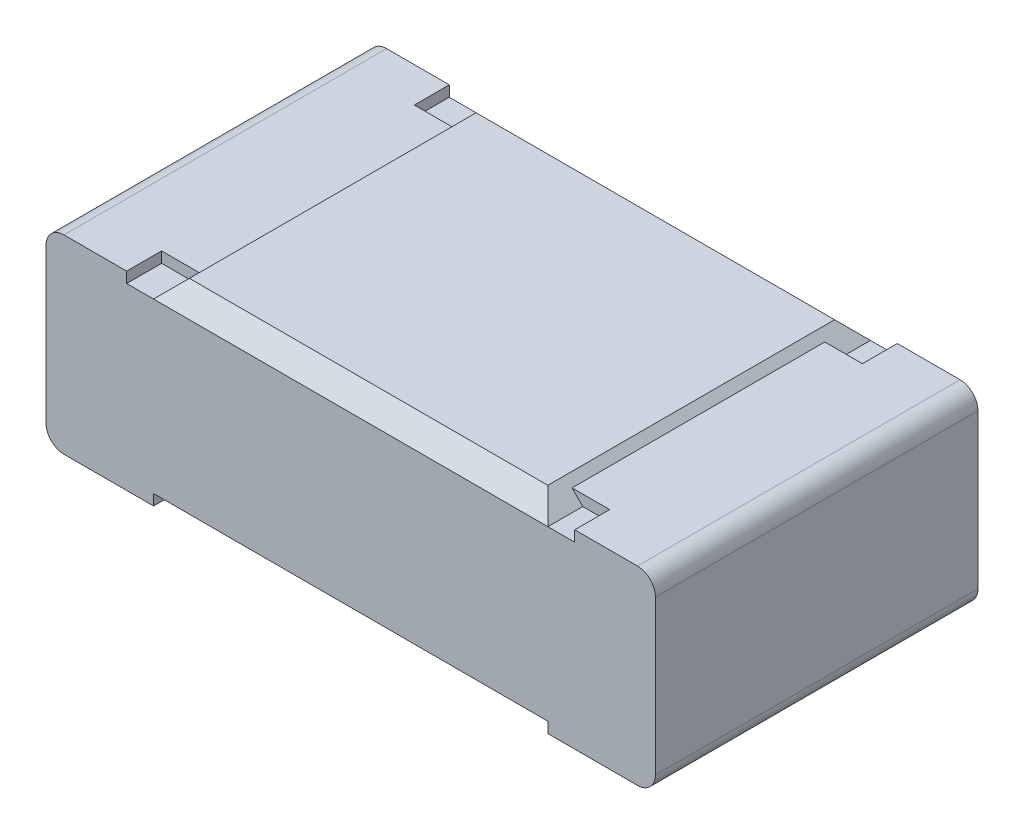
ISO-10303-21;
HEADER;
FILE_DESCRIPTION(('STEP AP214'),'2;1');
FILE_NAME('part.step','',(''),(''),'','','');
FILE_SCHEMA(('AUTOMOTIVE_DESIGN { 1 0 10303 214 1 1 1 1 }'));
ENDSEC;
DATA;
#1=APPLICATION_CONTEXT('core data for automotive mechanical design processes');
#2=APPLICATION_PROTOCOL_DEFINITION('international standard','automotive_design',2000,#1);
#3=PRODUCT_CONTEXT('',#1,'mechanical');
#4=PRODUCT('Part','Part','',(#3));
#5=PRODUCT_RELATED_PRODUCT_CATEGORY('part','',(#4));
#6=PRODUCT_DEFINITION_FORMATION('','',#4);
#7=PRODUCT_DEFINITION_CONTEXT('part definition',#1,'design');
#8=PRODUCT_DEFINITION('design','',#6,#7);
#9=PRODUCT_DEFINITION_SHAPE('','',#8);
#10=(LENGTH_UNIT() NAMED_UNIT(*) SI_UNIT(.MILLI.,.METRE.));
#11=(NAMED_UNIT(*) PLANE_ANGLE_UNIT() SI_UNIT($,.RADIAN.));
#12=(NAMED_UNIT(*) SI_UNIT($,.STERADIAN.) SOLID_ANGLE_UNIT());
#13=UNCERTAINTY_MEASURE_WITH_UNIT(LENGTH_MEASURE(1.E-05),#10,'distance_accuracy_value','');
#14=(GEOMETRIC_REPRESENTATION_CONTEXT(3) GLOBAL_UNCERTAINTY_ASSIGNED_CONTEXT((#13)) GLOBAL_UNIT_ASSIGNED_CONTEXT((#10,
#11,#12)) REPRESENTATION_CONTEXT('',''));
#15=CARTESIAN_POINT('',(0.,0.,0.));
#16=DIRECTION('',(0.,0.,1.));
#17=DIRECTION('',(1.,0.,0.));
#18=AXIS2_PLACEMENT_3D('',#15,#16,#17);
#19=CARTESIAN_POINT('',(-2.052710128787,-22.36241513081,1.021662858095));
#20=DIRECTION('',(1.,0.,0.));
#21=DIRECTION('',(0.,0.,-1.));
#22=AXIS2_PLACEMENT_3D('',#19,#20,#21);
#23=PLANE('',#22);
#24=DIRECTION('',(0.,1.,0.));
#25=VECTOR('',#24,1.);
#26=CARTESIAN_POINT('',(-2.052710128787,-22.36241513081,0.924162858095));
#27=LINE('',#26,#25);
#28=CARTESIAN_POINT('',(-2.052710128787,-22.3624151309644,0.924162858095));
#29=VERTEX_POINT('',#28);
#30=CARTESIAN_POINT('',(-2.052710128787,-22.33241513081,0.924162858095001));
#31=VERTEX_POINT('',#30);
#32=EDGE_CURVE('E396',#29,#31,#27,.T.);
#33=ORIENTED_EDGE('',*,*,#32,.F.);
#34=DIRECTION('',(0.,0.,1.));
#35=VECTOR('',#34,1.);
#36=CARTESIAN_POINT('',(-2.052710128787,-22.3624151311376,1.824162858095));
#37=LINE('',#36,#35);
#38=CARTESIAN_POINT('',(-2.052710128787,-22.3624151311376,1.021662858095));
#39=VERTEX_POINT('',#38);
#40=EDGE_CURVE('E246',#39,#29,#37,.F.);
#41=ORIENTED_EDGE('',*,*,#40,.F.);
#42=DIRECTION('',(0.,1.,0.));
#43=VECTOR('',#42,1.);
#44=CARTESIAN_POINT('',(-2.052710128787,-22.36241513081,1.021662858095));
#45=LINE('',#44,#43);
#46=CARTESIAN_POINT('',(-2.052710128787,-22.33241513081,1.021662858095));
#47=VERTEX_POINT('',#46);
#48=EDGE_CURVE('E380',#39,#47,#45,.T.);
#49=ORIENTED_EDGE('',*,*,#48,.T.);
#50=DIRECTION('',(0.,0.,1.));
#51=VECTOR('',#50,1.);
#52=CARTESIAN_POINT('',(-2.052710128787,-22.33241513081,1.824162858095));
#53=LINE('',#52,#51);
#54=EDGE_CURVE('E341',#31,#47,#53,.T.);
#55=ORIENTED_EDGE('',*,*,#54,.F.);
#56=EDGE_LOOP('',(#33,#41,#49,#55));
#57=FACE_BOUND('',#56,.T.);
#58=ADVANCED_FACE('F17',(#57),#23,.F.);
#59=CARTESIAN_POINT('',(-3.302710128787,-22.36241513081,1.021662858095));
#60=DIRECTION('',(0.,0.,1.));
#61=DIRECTION('',(1.,0.,0.));
#62=AXIS2_PLACEMENT_3D('',#59,#60,#61);
#63=PLANE('',#62);
#64=DIRECTION('',(-1.,0.,0.));
#65=VECTOR('',#64,1.);
#66=CARTESIAN_POINT('',(-2.227710128787,-22.33241513081,1.021662858095));
#67=LINE('',#66,#65);
#68=CARTESIAN_POINT('',(-2.15771012878251,-22.3324151308105,1.021662858095));
#69=VERTEX_POINT('',#68);
#70=EDGE_CURVE('E337',#47,#69,#67,.T.);
#71=ORIENTED_EDGE('',*,*,#70,.F.);
#72=ORIENTED_EDGE('',*,*,#48,.F.);
#73=DIRECTION('',(-1.,5.246521980196E-10,0.));
#74=VECTOR('',#73,1.);
#75=CARTESIAN_POINT('',(-3.477710128525,-22.36241513039,1.021662858095));
#76=LINE('',#75,#74);
#77=CARTESIAN_POINT('',(-2.12771012852529,-22.3624151310986,1.021662858095));
#78=VERTEX_POINT('',#77);
#79=EDGE_CURVE('E225',#78,#39,#76,.F.);
#80=ORIENTED_EDGE('',*,*,#79,.F.);
#81=DIRECTION('',(-0.707106780815548,0.707106781557548,0.));
#82=VECTOR('',#81,1.);
#83=CARTESIAN_POINT('',(-2.127710128525,-22.3624151311,1.021662858095));
#84=LINE('',#83,#82);
#85=EDGE_CURVE('E300',#69,#78,#84,.F.);
#86=ORIENTED_EDGE('',*,*,#85,.F.);
#87=EDGE_LOOP('',(#71,#72,#80,#86));
#88=FACE_BOUND('',#87,.T.);
#89=ADVANCED_FACE('F576',(#88),#63,.F.);
#90=CARTESIAN_POINT('',(-3.302710128787,-22.36241513081,0.924162858095));
#91=DIRECTION('',(-1.,0.,0.));
#92=DIRECTION('',(0.,0.,1.));
#93=AXIS2_PLACEMENT_3D('',#90,#91,#92);
#94=PLANE('',#93);
#95=DIRECTION('',(0.,1.,0.));
#96=VECTOR('',#95,1.);
#97=CARTESIAN_POINT('',(-3.302710128787,-22.36241513081,1.021662858095));
#98=LINE('',#97,#96);
#99=CARTESIAN_POINT('',(-3.302710128787,-22.33241513081,1.021662858095));
#100=VERTEX_POINT('',#99);
#101=CARTESIAN_POINT('',(-3.302710128787,-22.3624151304818,1.021662858095));
#102=VERTEX_POINT('',#101);
#103=EDGE_CURVE('E363',#100,#102,#98,.F.);
#104=ORIENTED_EDGE('',*,*,#103,.T.);
#105=DIRECTION('',(0.,0.,1.));
#106=VECTOR('',#105,1.);
#107=CARTESIAN_POINT('',(-3.302710128787,-22.3624151304818,1.824162858095));
#108=LINE('',#107,#106);
#109=CARTESIAN_POINT('',(-3.302710128787,-22.362415130728,0.924162858094999));
#110=VERTEX_POINT('',#109);
#111=EDGE_CURVE('E376',#110,#102,#108,.T.);
#112=ORIENTED_EDGE('',*,*,#111,.F.);
#113=DIRECTION('',(0.,1.,0.));
#114=VECTOR('',#113,1.);
#115=CARTESIAN_POINT('',(-3.302710128787,-22.86241513081,0.924162858094999));
#116=LINE('',#115,#114);
#117=CARTESIAN_POINT('',(-3.302710128787,-22.33241513081,0.924162858094999));
#118=VERTEX_POINT('',#117);
#119=EDGE_CURVE('E236',#118,#110,#116,.F.);
#120=ORIENTED_EDGE('',*,*,#119,.F.);
#121=DIRECTION('',(0.,0.,1.));
#122=VECTOR('',#121,1.);
#123=CARTESIAN_POINT('',(-3.302710128787,-22.33241513081,1.824162858095));
#124=LINE('',#123,#122);
#125=EDGE_CURVE('E322',#100,#118,#124,.F.);
#126=ORIENTED_EDGE('',*,*,#125,.F.);
#127=EDGE_LOOP('',(#104,#112,#120,#126));
#128=FACE_BOUND('',#127,.T.);
#129=ADVANCED_FACE('F927',(#128),#94,.F.);
#130=CARTESIAN_POINT('',(-3.302710128787,-22.36241513081,1.021662858095));
#131=DIRECTION('',(0.,0.,1.));
#132=DIRECTION('',(1.,0.,0.));
#133=AXIS2_PLACEMENT_3D('',#130,#131,#132);
#134=PLANE('',#133);
#135=DIRECTION('',(-1.,5.246521980196E-10,0.));
#136=VECTOR('',#135,1.);
#137=CARTESIAN_POINT('',(-3.477710128525,-22.36241513039,1.021662858095));
#138=LINE('',#137,#136);
#139=CARTESIAN_POINT('',(-3.22771012852519,-22.362415130521,1.021662858095));
#140=VERTEX_POINT('',#139);
#141=EDGE_CURVE('E276',#102,#140,#138,.F.);
#142=ORIENTED_EDGE('',*,*,#141,.F.);
#143=ORIENTED_EDGE('',*,*,#103,.F.);
#144=DIRECTION('',(-1.,0.,0.));
#145=VECTOR('',#144,1.);
#146=CARTESIAN_POINT('',(-3.477710128787,-22.33241513081,1.021662858095));
#147=LINE('',#146,#145);
#148=CARTESIAN_POINT('',(-3.19771012878276,-22.3324151308095,1.021662858095));
#149=VERTEX_POINT('',#148);
#150=EDGE_CURVE('E326',#149,#100,#147,.T.);
#151=ORIENTED_EDGE('',*,*,#150,.F.);
#152=DIRECTION('',(-0.707106781557548,-0.707106780815548,0.));
#153=VECTOR('',#152,1.);
#154=CARTESIAN_POINT('',(-3.227710128525,-22.36241513052,1.021662858095));
#155=LINE('',#154,#153);
#156=EDGE_CURVE('E299',#140,#149,#155,.F.);
#157=ORIENTED_EDGE('',*,*,#156,.F.);
#158=EDGE_LOOP('',(#142,#143,#151,#157));
#159=FACE_BOUND('',#158,.T.);
#160=ADVANCED_FACE('F633',(#159),#134,.F.);
#161=CARTESIAN_POINT('',(-2.052710128787,-22.36241513081,1.824162858095));
#162=DIRECTION('',(1.,0.,0.));
#163=DIRECTION('',(0.,1.,0.));
#164=AXIS2_PLACEMENT_3D('',#161,#162,#163);
#165=PLANE('',#164);
#166=DIRECTION('',(0.,1.,0.));
#167=VECTOR('',#166,1.);
#168=CARTESIAN_POINT('',(-2.052710128787,-22.36241513081,1.726662858095));
#169=LINE('',#168,#167);
#170=CARTESIAN_POINT('',(-2.052710128787,-22.33241513081,1.726662858095));
#171=VERTEX_POINT('',#170);
#172=CARTESIAN_POINT('',(-2.052710128787,-22.3624151311376,1.726662858095));
#173=VERTEX_POINT('',#172);
#174=EDGE_CURVE('E357',#171,#173,#169,.F.);
#175=ORIENTED_EDGE('',*,*,#174,.T.);
#176=DIRECTION('',(0.,0.,1.));
#177=VECTOR('',#176,1.);
#178=CARTESIAN_POINT('',(-2.052710128787,-22.3624151311376,1.824162858095));
#179=LINE('',#178,#177);
#180=CARTESIAN_POINT('',(-2.052710128787,-22.3624151309644,1.824162858095));
#181=VERTEX_POINT('',#180);
#182=EDGE_CURVE('E334',#181,#173,#179,.F.);
#183=ORIENTED_EDGE('',*,*,#182,.F.);
#184=DIRECTION('',(0.,1.,0.));
#185=VECTOR('',#184,1.);
#186=CARTESIAN_POINT('',(-2.052710128787,-22.36241513081,1.824162858095));
#187=LINE('',#186,#185);
#188=CARTESIAN_POINT('',(-2.052710128787,-22.33241513081,1.824162858095));
#189=VERTEX_POINT('',#188);
#190=EDGE_CURVE('E359',#189,#181,#187,.F.);
#191=ORIENTED_EDGE('',*,*,#190,.F.);
#192=DIRECTION('',(0.,0.,1.));
#193=VECTOR('',#192,1.);
#194=CARTESIAN_POINT('',(-2.052710128787,-22.33241513081,1.824162858095));
#195=LINE('',#194,#193);
#196=EDGE_CURVE('E338',#171,#189,#195,.T.);
#197=ORIENTED_EDGE('',*,*,#196,.F.);
#198=EDGE_LOOP('',(#175,#183,#191,#197));
#199=FACE_BOUND('',#198,.T.);
#200=ADVANCED_FACE('F598',(#199),#165,.F.);
#201=CARTESIAN_POINT('',(-2.052710128787,-22.36241513081,1.726662858095));
#202=DIRECTION('',(0.,0.,-1.));
#203=DIRECTION('',(-1.,0.,0.));
#204=AXIS2_PLACEMENT_3D('',#201,#202,#203);
#205=PLANE('',#204);
#206=DIRECTION('',(-1.,5.246521980196E-10,0.));
#207=VECTOR('',#206,1.);
#208=CARTESIAN_POINT('',(-3.477710128525,-22.36241513039,1.726662858095));
#209=LINE('',#208,#207);
#210=CARTESIAN_POINT('',(-2.12771012852529,-22.3624151310986,1.726662858095));
#211=VERTEX_POINT('',#210);
#212=EDGE_CURVE('E351',#173,#211,#209,.T.);
#213=ORIENTED_EDGE('',*,*,#212,.F.);
#214=ORIENTED_EDGE('',*,*,#174,.F.);
#215=DIRECTION('',(-1.,0.,0.));
#216=VECTOR('',#215,1.);
#217=CARTESIAN_POINT('',(-2.227710128787,-22.33241513081,1.726662858095));
#218=LINE('',#217,#216);
#219=CARTESIAN_POINT('',(-2.15771012878276,-22.3324151308105,1.726662858095));
#220=VERTEX_POINT('',#219);
#221=EDGE_CURVE('E342',#220,#171,#218,.F.);
#222=ORIENTED_EDGE('',*,*,#221,.F.);
#223=DIRECTION('',(-0.707106780815548,0.707106781557548,0.));
#224=VECTOR('',#223,1.);
#225=CARTESIAN_POINT('',(-2.127710128525,-22.3624151311,1.726662858095));
#226=LINE('',#225,#224);
#227=EDGE_CURVE('E345',#211,#220,#226,.T.);
#228=ORIENTED_EDGE('',*,*,#227,.F.);
#229=EDGE_LOOP('',(#213,#214,#222,#228));
#230=FACE_BOUND('',#229,.T.);
#231=ADVANCED_FACE('F566',(#230),#205,.F.);
#232=CARTESIAN_POINT('',(-2.227710128787,-22.33241513081,1.824162858095));
#233=DIRECTION('',(0.,1.,0.));
#234=DIRECTION('',(-1.,0.,0.));
#235=AXIS2_PLACEMENT_3D('',#232,#233,#234);
#236=PLANE('',#235);
#237=ORIENTED_EDGE('',*,*,#54,.T.);
#238=ORIENTED_EDGE('',*,*,#70,.T.);
#239=DIRECTION('',(0.,0.,1.));
#240=VECTOR('',#239,1.);
#241=CARTESIAN_POINT('',(-2.15771012878276,-22.3324151308108,1.824162858095));
#242=LINE('',#241,#240);
#243=EDGE_CURVE('E348',#220,#69,#242,.F.);
#244=ORIENTED_EDGE('',*,*,#243,.F.);
#245=ORIENTED_EDGE('',*,*,#221,.T.);
#246=ORIENTED_EDGE('',*,*,#196,.T.);
#247=DIRECTION('',(-1.,0.,0.));
#248=VECTOR('',#247,1.);
#249=CARTESIAN_POINT('',(-2.677710128787,-22.33241513081,1.824162858095));
#250=LINE('',#249,#248);
#251=CARTESIAN_POINT('',(-1.877710128787,-22.33241513081,1.824162858095));
#252=VERTEX_POINT('',#251);
#253=EDGE_CURVE('E448',#189,#252,#250,.F.);
#254=ORIENTED_EDGE('',*,*,#253,.T.);
#255=DIRECTION('',(0.,0.,-1.));
#256=VECTOR('',#255,1.);
#257=CARTESIAN_POINT('',(-1.877710128787,-22.33241513081,1.824162858095));
#258=LINE('',#257,#256);
#259=CARTESIAN_POINT('',(-1.877710128787,-22.33241513081,0.924162858095001));
#260=VERTEX_POINT('',#259);
#261=EDGE_CURVE('E198',#260,#252,#258,.F.);
#262=ORIENTED_EDGE('',*,*,#261,.F.);
#263=DIRECTION('',(-1.,0.,0.));
#264=VECTOR('',#263,1.);
#265=CARTESIAN_POINT('',(-2.677710128787,-22.33241513081,0.924162858095));
#266=LINE('',#265,#264);
#267=EDGE_CURVE('E224',#31,#260,#266,.F.);
#268=ORIENTED_EDGE('',*,*,#267,.F.);
#269=EDGE_LOOP('',(#237,#238,#244,#245,#246,#254,#262,#268));
#270=FACE_BOUND('',#269,.T.);
#271=ADVANCED_FACE('F571',(#270),#236,.T.);
#272=CARTESIAN_POINT('',(-1.877710128787,-22.38241513081,1.824162858095));
#273=DIRECTION('',(0.,0.,-1.));
#274=DIRECTION('',(-1.,0.,0.));
#275=AXIS2_PLACEMENT_3D('',#272,#273,#274);
#276=CYLINDRICAL_SURFACE('',#275,0.05);
#277=CARTESIAN_POINT('',(-1.877710128787,-22.38241513081,0.924162858095));
#278=DIRECTION('',(0.,0.,-1.));
#279=DIRECTION('',(-1.,0.,0.));
#280=AXIS2_PLACEMENT_3D('',#277,#278,#279);
#281=CIRCLE('',#280,0.05);
#282=CARTESIAN_POINT('',(-1.827710128787,-22.38241513081,0.924162858095001));
#283=VERTEX_POINT('',#282);
#284=EDGE_CURVE('E20',#260,#283,#281,.T.);
#285=ORIENTED_EDGE('',*,*,#284,.F.);
#286=ORIENTED_EDGE('',*,*,#261,.T.);
#287=CARTESIAN_POINT('',(-1.877710128787,-22.38241513081,1.824162858095));
#288=DIRECTION('',(0.,0.,-1.));
#289=DIRECTION('',(-1.,0.,0.));
#290=AXIS2_PLACEMENT_3D('',#287,#288,#289);
#291=CIRCLE('',#290,0.05);
#292=CARTESIAN_POINT('',(-1.827710128787,-22.38241513081,1.824162858095));
#293=VERTEX_POINT('',#292);
#294=EDGE_CURVE('E209',#252,#293,#291,.T.);
#295=ORIENTED_EDGE('',*,*,#294,.T.);
#296=DIRECTION('',(0.,0.,-1.));
#297=VECTOR('',#296,1.);
#298=CARTESIAN_POINT('',(-1.827710128787,-22.38241513081,1.824162858095));
#299=LINE('',#298,#297);
#300=EDGE_CURVE('E203',#283,#293,#299,.F.);
#301=ORIENTED_EDGE('',*,*,#300,.F.);
#302=EDGE_LOOP('',(#285,#286,#295,#301));
#303=FACE_BOUND('',#302,.T.);
#304=ADVANCED_FACE('F205',(#303),#276,.T.);
#305=CARTESIAN_POINT('',(-1.827710128787,-22.38241513081,1.824162858095));
#306=DIRECTION('',(1.,0.,0.));
#307=DIRECTION('',(0.,0.,-1.));
#308=AXIS2_PLACEMENT_3D('',#305,#306,#307);
#309=PLANE('',#308);
#310=DIRECTION('',(0.,1.,0.));
#311=VECTOR('',#310,1.);
#312=CARTESIAN_POINT('',(-1.827710128787,-22.86241513081,0.924162858095001));
#313=LINE('',#312,#311);
#314=CARTESIAN_POINT('',(-1.827710128787,-22.81241513081,0.924162858095001));
#315=VERTEX_POINT('',#314);
#316=EDGE_CURVE('E215',#283,#315,#313,.F.);
#317=ORIENTED_EDGE('',*,*,#316,.F.);
#318=ORIENTED_EDGE('',*,*,#300,.T.);
#319=DIRECTION('',(0.,1.,0.));
#320=VECTOR('',#319,1.);
#321=CARTESIAN_POINT('',(-1.827710128787,-22.86241513081,1.824162858095));
#322=LINE('',#321,#320);
#323=CARTESIAN_POINT('',(-1.827710128787,-22.81241513081,1.824162858095));
#324=VERTEX_POINT('',#323);
#325=EDGE_CURVE('E446',#293,#324,#322,.F.);
#326=ORIENTED_EDGE('',*,*,#325,.T.);
#327=DIRECTION('',(0.,0.,-1.));
#328=VECTOR('',#327,1.);
#329=CARTESIAN_POINT('',(-1.827710128787,-22.81241513081,1.824162858095));
#330=LINE('',#329,#328);
#331=EDGE_CURVE('E212',#315,#324,#330,.F.);
#332=ORIENTED_EDGE('',*,*,#331,.F.);
#333=EDGE_LOOP('',(#317,#318,#326,#332));
#334=FACE_BOUND('',#333,.T.);
#335=ADVANCED_FACE('F216',(#334),#309,.T.);
#336=CARTESIAN_POINT('',(-1.877710128787,-22.81241513081,1.824162858095));
#337=DIRECTION('',(0.,0.,-1.));
#338=DIRECTION('',(-1.,0.,0.));
#339=AXIS2_PLACEMENT_3D('',#336,#337,#338);
#340=CYLINDRICAL_SURFACE('',#339,0.05);
#341=CARTESIAN_POINT('',(-1.877710128787,-22.81241513081,0.924162858095));
#342=DIRECTION('',(0.,0.,-1.));
#343=DIRECTION('',(-1.,0.,0.));
#344=AXIS2_PLACEMENT_3D('',#341,#342,#343);
#345=CIRCLE('',#344,0.05);
#346=CARTESIAN_POINT('',(-1.877710128787,-22.86241513081,0.924162858095));
#347=VERTEX_POINT('',#346);
#348=EDGE_CURVE('E220',#315,#347,#345,.T.);
#349=ORIENTED_EDGE('',*,*,#348,.F.);
#350=ORIENTED_EDGE('',*,*,#331,.T.);
#351=CARTESIAN_POINT('',(-1.877710128787,-22.81241513081,1.824162858095));
#352=DIRECTION('',(0.,0.,-1.));
#353=DIRECTION('',(-1.,0.,0.));
#354=AXIS2_PLACEMENT_3D('',#351,#352,#353);
#355=CIRCLE('',#354,0.05);
#356=CARTESIAN_POINT('',(-1.877710128787,-22.86241513081,1.824162858095));
#357=VERTEX_POINT('',#356);
#358=EDGE_CURVE('E443',#324,#357,#355,.T.);
#359=ORIENTED_EDGE('',*,*,#358,.T.);
#360=DIRECTION('',(0.,0.,1.));
#361=VECTOR('',#360,1.);
#362=CARTESIAN_POINT('',(-1.877710128787,-22.86241513081,1.824162858095));
#363=LINE('',#362,#361);
#364=EDGE_CURVE('E331',#347,#357,#363,.T.);
#365=ORIENTED_EDGE('',*,*,#364,.F.);
#366=EDGE_LOOP('',(#349,#350,#359,#365));
#367=FACE_BOUND('',#366,.T.);
#368=ADVANCED_FACE('F461',(#367),#340,.T.);
#369=CARTESIAN_POINT('',(-3.477710128787,-22.81241513081,1.824162858095));
#370=DIRECTION('',(0.,0.,-1.));
#371=DIRECTION('',(-1.,0.,0.));
#372=AXIS2_PLACEMENT_3D('',#369,#370,#371);
#373=CYLINDRICAL_SURFACE('',#372,0.05);
#374=CARTESIAN_POINT('',(-3.477710128787,-22.81241513081,0.924162858095));
#375=DIRECTION('',(0.,0.,-1.));
#376=DIRECTION('',(-1.,0.,0.));
#377=AXIS2_PLACEMENT_3D('',#374,#375,#376);
#378=CIRCLE('',#377,0.05);
#379=CARTESIAN_POINT('',(-3.477710128787,-22.86241513081,0.924162858094999));
#380=VERTEX_POINT('',#379);
#381=CARTESIAN_POINT('',(-3.527710128787,-22.81241513081,0.924162858094999));
#382=VERTEX_POINT('',#381);
#383=EDGE_CURVE('E454',#380,#382,#378,.T.);
#384=ORIENTED_EDGE('',*,*,#383,.F.);
#385=DIRECTION('',(0.,0.,1.));
#386=VECTOR('',#385,1.);
#387=CARTESIAN_POINT('',(-3.477710128787,-22.86241513081,1.824162858095));
#388=LINE('',#387,#386);
#389=CARTESIAN_POINT('',(-3.477710128787,-22.86241513081,1.824162858095));
#390=VERTEX_POINT('',#389);
#391=EDGE_CURVE('E269',#390,#380,#388,.F.);
#392=ORIENTED_EDGE('',*,*,#391,.F.);
#393=CARTESIAN_POINT('',(-3.477710128787,-22.81241513081,1.824162858095));
#394=DIRECTION('',(0.,0.,-1.));
#395=DIRECTION('',(-1.,0.,0.));
#396=AXIS2_PLACEMENT_3D('',#393,#394,#395);
#397=CIRCLE('',#396,0.05);
#398=CARTESIAN_POINT('',(-3.527710128787,-22.81241513081,1.824162858095));
#399=VERTEX_POINT('',#398);
#400=EDGE_CURVE('E440',#390,#399,#397,.T.);
#401=ORIENTED_EDGE('',*,*,#400,.T.);
#402=DIRECTION('',(0.,0.,1.));
#403=VECTOR('',#402,1.);
#404=CARTESIAN_POINT('',(-3.527710128787,-22.81241513081,1.824162858095));
#405=LINE('',#404,#403);
#406=EDGE_CURVE('E327',#382,#399,#405,.T.);
#407=ORIENTED_EDGE('',*,*,#406,.F.);
#408=EDGE_LOOP('',(#384,#392,#401,#407));
#409=FACE_BOUND('',#408,.T.);
#410=ADVANCED_FACE('F611',(#409),#373,.T.);
#411=CARTESIAN_POINT('',(-3.527710128787,-22.81241513081,1.824162858095));
#412=DIRECTION('',(-1.,0.,0.));
#413=DIRECTION('',(0.,-1.,0.));
#414=AXIS2_PLACEMENT_3D('',#411,#412,#413);
#415=PLANE('',#414);
#416=DIRECTION('',(0.,1.,0.));
#417=VECTOR('',#416,1.);
#418=CARTESIAN_POINT('',(-3.527710128787,-22.86241513081,0.924162858094999));
#419=LINE('',#418,#417);
#420=CARTESIAN_POINT('',(-3.527710128787,-22.38241513081,0.924162858095));
#421=VERTEX_POINT('',#420);
#422=EDGE_CURVE('E453',#382,#421,#419,.T.);
#423=ORIENTED_EDGE('',*,*,#422,.F.);
#424=ORIENTED_EDGE('',*,*,#406,.T.);
#425=DIRECTION('',(0.,1.,0.));
#426=VECTOR('',#425,1.);
#427=CARTESIAN_POINT('',(-3.527710128787,-22.86241513081,1.824162858095));
#428=LINE('',#427,#426);
#429=CARTESIAN_POINT('',(-3.527710128787,-22.38241513081,1.824162858095));
#430=VERTEX_POINT('',#429);
#431=EDGE_CURVE('E439',#399,#430,#428,.T.);
#432=ORIENTED_EDGE('',*,*,#431,.T.);
#433=DIRECTION('',(0.,0.,-1.));
#434=VECTOR('',#433,1.);
#435=CARTESIAN_POINT('',(-3.527710128787,-22.38241513081,1.824162858095));
#436=LINE('',#435,#434);
#437=EDGE_CURVE('E323',#421,#430,#436,.F.);
#438=ORIENTED_EDGE('',*,*,#437,.F.);
#439=EDGE_LOOP('',(#423,#424,#432,#438));
#440=FACE_BOUND('',#439,.T.);
#441=ADVANCED_FACE('F615',(#440),#415,.T.);
#442=CARTESIAN_POINT('',(-3.477710128787,-22.38241513081,1.824162858095));
#443=DIRECTION('',(0.,0.,-1.));
#444=DIRECTION('',(-1.,0.,0.));
#445=AXIS2_PLACEMENT_3D('',#442,#443,#444);
#446=CYLINDRICAL_SURFACE('',#445,0.05);
#447=CARTESIAN_POINT('',(-3.477710128787,-22.38241513081,0.924162858095));
#448=DIRECTION('',(0.,0.,-1.));
#449=DIRECTION('',(-1.,0.,0.));
#450=AXIS2_PLACEMENT_3D('',#447,#448,#449);
#451=CIRCLE('',#450,0.05);
#452=CARTESIAN_POINT('',(-3.477710128787,-22.33241513081,0.924162858094999));
#453=VERTEX_POINT('',#452);
#454=EDGE_CURVE('E449',#421,#453,#451,.T.);
#455=ORIENTED_EDGE('',*,*,#454,.F.);
#456=ORIENTED_EDGE('',*,*,#437,.T.);
#457=CARTESIAN_POINT('',(-3.477710128787,-22.38241513081,1.824162858095));
#458=DIRECTION('',(0.,0.,-1.));
#459=DIRECTION('',(-1.,0.,0.));
#460=AXIS2_PLACEMENT_3D('',#457,#458,#459);
#461=CIRCLE('',#460,0.05);
#462=CARTESIAN_POINT('',(-3.477710128787,-22.33241513081,1.824162858095));
#463=VERTEX_POINT('',#462);
#464=EDGE_CURVE('E436',#430,#463,#461,.T.);
#465=ORIENTED_EDGE('',*,*,#464,.T.);
#466=DIRECTION('',(0.,0.,1.));
#467=VECTOR('',#466,1.);
#468=CARTESIAN_POINT('',(-3.477710128787,-22.33241513081,1.824162858095));
#469=LINE('',#468,#467);
#470=EDGE_CURVE('E317',#453,#463,#469,.T.);
#471=ORIENTED_EDGE('',*,*,#470,.F.);
#472=EDGE_LOOP('',(#455,#456,#465,#471));
#473=FACE_BOUND('',#472,.T.);
#474=ADVANCED_FACE('F619',(#473),#446,.T.);
#475=CARTESIAN_POINT('',(-3.477710128787,-22.33241513081,1.824162858095));
#476=DIRECTION('',(0.,1.,0.));
#477=DIRECTION('',(-1.,0.,0.));
#478=AXIS2_PLACEMENT_3D('',#475,#476,#477);
#479=PLANE('',#478);
#480=DIRECTION('',(0.,0.,1.));
#481=VECTOR('',#480,1.);
#482=CARTESIAN_POINT('',(-3.302710128787,-22.33241513081,1.726662858095));
#483=LINE('',#482,#481);
#484=CARTESIAN_POINT('',(-3.302710128787,-22.33241513081,1.824162858095));
#485=VERTEX_POINT('',#484);
#486=CARTESIAN_POINT('',(-3.302710128787,-22.33241513081,1.726662858095));
#487=VERTEX_POINT('',#486);
#488=EDGE_CURVE('E307',#485,#487,#483,.F.);
#489=ORIENTED_EDGE('',*,*,#488,.T.);
#490=DIRECTION('',(-1.,0.,0.));
#491=VECTOR('',#490,1.);
#492=CARTESIAN_POINT('',(-2.052710128787,-22.33241513081,1.726662858095));
#493=LINE('',#492,#491);
#494=CARTESIAN_POINT('',(-3.19771012878219,-22.3324151308098,1.726662858095));
#495=VERTEX_POINT('',#494);
#496=EDGE_CURVE('E306',#487,#495,#493,.F.);
#497=ORIENTED_EDGE('',*,*,#496,.T.);
#498=DIRECTION('',(0.,0.,1.));
#499=VECTOR('',#498,1.);
#500=CARTESIAN_POINT('',(-3.19771012878276,-22.3324151308092,0.924162858095));
#501=LINE('',#500,#499);
#502=EDGE_CURVE('E289',#149,#495,#501,.T.);
#503=ORIENTED_EDGE('',*,*,#502,.F.);
#504=ORIENTED_EDGE('',*,*,#150,.T.);
#505=ORIENTED_EDGE('',*,*,#125,.T.);
#506=DIRECTION('',(-1.,0.,0.));
#507=VECTOR('',#506,1.);
#508=CARTESIAN_POINT('',(-2.677710128787,-22.33241513081,0.924162858095));
#509=LINE('',#508,#507);
#510=EDGE_CURVE('E452',#453,#118,#509,.F.);
#511=ORIENTED_EDGE('',*,*,#510,.F.);
#512=ORIENTED_EDGE('',*,*,#470,.T.);
#513=DIRECTION('',(-1.,0.,0.));
#514=VECTOR('',#513,1.);
#515=CARTESIAN_POINT('',(-2.677710128787,-22.33241513081,1.824162858095));
#516=LINE('',#515,#514);
#517=EDGE_CURVE('E438',#463,#485,#516,.F.);
#518=ORIENTED_EDGE('',*,*,#517,.T.);
#519=EDGE_LOOP('',(#489,#497,#503,#504,#505,#511,#512,#518));
#520=FACE_BOUND('',#519,.T.);
#521=ADVANCED_FACE('F623',(#520),#479,.T.);
#522=CARTESIAN_POINT('',(-3.302710128787,-22.36241513081,1.726662858095));
#523=DIRECTION('',(-1.,0.,0.));
#524=DIRECTION('',(0.,-1.,0.));
#525=AXIS2_PLACEMENT_3D('',#522,#523,#524);
#526=PLANE('',#525);
#527=DIRECTION('',(0.,1.,0.));
#528=VECTOR('',#527,1.);
#529=CARTESIAN_POINT('',(-3.302710128787,-22.86241513081,1.824162858095));
#530=LINE('',#529,#528);
#531=CARTESIAN_POINT('',(-3.302710128787,-22.362415130728,1.824162858095));
#532=VERTEX_POINT('',#531);
#533=EDGE_CURVE('E646',#485,#532,#530,.F.);
#534=ORIENTED_EDGE('',*,*,#533,.T.);
#535=DIRECTION('',(0.,0.,1.));
#536=VECTOR('',#535,1.);
#537=CARTESIAN_POINT('',(-3.302710128787,-22.3624151304818,1.824162858095));
#538=LINE('',#537,#536);
#539=CARTESIAN_POINT('',(-3.302710128787,-22.3624151304818,1.726662858095));
#540=VERTEX_POINT('',#539);
#541=EDGE_CURVE('E644',#540,#532,#538,.T.);
#542=ORIENTED_EDGE('',*,*,#541,.F.);
#543=DIRECTION('',(0.,1.,0.));
#544=VECTOR('',#543,1.);
#545=CARTESIAN_POINT('',(-3.302710128787,-22.36241513081,1.726662858095));
#546=LINE('',#545,#544);
#547=EDGE_CURVE('E303',#540,#487,#546,.T.);
#548=ORIENTED_EDGE('',*,*,#547,.T.);
#549=ORIENTED_EDGE('',*,*,#488,.F.);
#550=EDGE_LOOP('',(#534,#542,#548,#549));
#551=FACE_BOUND('',#550,.T.);
#552=ADVANCED_FACE('F661',(#551),#526,.F.);
#553=CARTESIAN_POINT('',(-2.052710128787,-22.36241513081,1.726662858095));
#554=DIRECTION('',(0.,0.,-1.));
#555=DIRECTION('',(-1.,0.,0.));
#556=AXIS2_PLACEMENT_3D('',#553,#554,#555);
#557=PLANE('',#556);
#558=ORIENTED_EDGE('',*,*,#496,.F.);
#559=ORIENTED_EDGE('',*,*,#547,.F.);
#560=DIRECTION('',(-1.,5.246521980196E-10,0.));
#561=VECTOR('',#560,1.);
#562=CARTESIAN_POINT('',(-3.477710128525,-22.36241513039,1.726662858095));
#563=LINE('',#562,#561);
#564=CARTESIAN_POINT('',(-3.227710128525,-22.3624151305203,1.726662858095));
#565=VERTEX_POINT('',#564);
#566=EDGE_CURVE('E310',#565,#540,#563,.T.);
#567=ORIENTED_EDGE('',*,*,#566,.F.);
#568=DIRECTION('',(-0.707106781557548,-0.707106780815548,0.));
#569=VECTOR('',#568,1.);
#570=CARTESIAN_POINT('',(-3.227710128525,-22.36241513052,1.726662858095));
#571=LINE('',#570,#569);
#572=EDGE_CURVE('E285',#495,#565,#571,.T.);
#573=ORIENTED_EDGE('',*,*,#572,.F.);
#574=EDGE_LOOP('',(#558,#559,#567,#573));
#575=FACE_BOUND('',#574,.T.);
#576=ADVANCED_FACE('F640',(#575),#557,.F.);
#577=CARTESIAN_POINT('',(-2.127710128525,-22.3624151311,1.824162858095));
#578=DIRECTION('',(0.707106781557548,0.707106780815548,0.));
#579=DIRECTION('',(-0.707106780815548,0.707106781557548,0.));
#580=AXIS2_PLACEMENT_3D('',#577,#578,#579);
#581=PLANE('',#580);
#582=DIRECTION('',(-0.577350268866298,0.577350269502744,-0.577350269199835));
#583=VECTOR('',#582,1.);
#584=CARTESIAN_POINT('',(-2.127710128525,-22.3624151310986,1.82416285809645));
#585=LINE('',#584,#583);
#586=CARTESIAN_POINT('',(-2.12771012860958,-22.3624151309421,1.82416285808328));
#587=VERTEX_POINT('',#586);
#588=CARTESIAN_POINT('',(-2.177710128498,-22.3124151310711,1.77416285809456));
#589=VERTEX_POINT('',#588);
#590=EDGE_CURVE('E294',#587,#589,#585,.T.);
#591=ORIENTED_EDGE('',*,*,#590,.F.);
#592=DIRECTION('',(0.,0.,1.));
#593=VECTOR('',#592,1.);
#594=CARTESIAN_POINT('',(-2.127710128525,-22.3624151310983,1.824162858095));
#595=LINE('',#594,#593);
#596=EDGE_CURVE('E354',#211,#587,#595,.T.);
#597=ORIENTED_EDGE('',*,*,#596,.F.);
#598=ORIENTED_EDGE('',*,*,#227,.T.);
#599=ORIENTED_EDGE('',*,*,#243,.T.);
#600=ORIENTED_EDGE('',*,*,#85,.T.);
#601=DIRECTION('',(0.,0.,1.));
#602=VECTOR('',#601,1.);
#603=CARTESIAN_POINT('',(-2.127710128525,-22.3624151310983,1.824162858095));
#604=LINE('',#603,#602);
#605=CARTESIAN_POINT('',(-2.127710128525,-22.3624151309546,0.924162858095001));
#606=VERTEX_POINT('',#605);
#607=EDGE_CURVE('E228',#606,#78,#604,.T.);
#608=ORIENTED_EDGE('',*,*,#607,.F.);
#609=DIRECTION('',(0.577350268866299,-0.577350269502745,-0.577350269199833));
#610=VECTOR('',#609,1.);
#611=CARTESIAN_POINT('',(-2.177710128498,-22.3124151310719,0.974162858096885));
#612=LINE('',#611,#610);
#613=CARTESIAN_POINT('',(-2.17771012862838,-22.3124151308987,0.97416285826959));
#614=VERTEX_POINT('',#613);
#615=EDGE_CURVE('E249',#614,#606,#612,.T.);
#616=ORIENTED_EDGE('',*,*,#615,.F.);
#617=DIRECTION('',(0.,0.,1.));
#618=VECTOR('',#617,1.);
#619=CARTESIAN_POINT('',(-2.177710128498,-22.3124151310723,1.374162858095));
#620=LINE('',#619,#618);
#621=EDGE_CURVE('E297',#589,#614,#620,.F.);
#622=ORIENTED_EDGE('',*,*,#621,.F.);
#623=EDGE_LOOP('',(#591,#597,#598,#599,#600,#608,#616,#622));
#624=FACE_BOUND('',#623,.T.);
#625=ADVANCED_FACE('F559',(#624),#581,.T.);
#626=CARTESIAN_POINT('',(-2.677710128498,-22.31241513081,1.374162858095));
#627=DIRECTION('',(5.246521980196E-10,1.,0.));
#628=DIRECTION('',(-1.,5.246521980196E-10,0.));
#629=AXIS2_PLACEMENT_3D('',#626,#627,#628);
#630=PLANE('',#629);
#631=DIRECTION('',(1.,-2.62325371029634E-10,-2.62325371029634E-10));
#632=VECTOR('',#631,1.);
#633=CARTESIAN_POINT('',(-3.227710128525,-22.312415130795,1.77416285837));
#634=LINE('',#633,#632);
#635=CARTESIAN_POINT('',(-3.17771012853192,-22.3124151306779,1.77416285825868));
#636=VERTEX_POINT('',#635);
#637=EDGE_CURVE('E290',#589,#636,#634,.F.);
#638=ORIENTED_EDGE('',*,*,#637,.F.);
#639=ORIENTED_EDGE('',*,*,#621,.T.);
#640=DIRECTION('',(1.,-2.6232682068155E-10,2.6232682068155E-10));
#641=VECTOR('',#640,1.);
#642=CARTESIAN_POINT('',(-2.127710128525,-22.312415130825,0.974162858370001));
#643=LINE('',#642,#641);
#644=CARTESIAN_POINT('',(-3.17771012849876,-22.3124151305489,0.974162858094705));
#645=VERTEX_POINT('',#644);
#646=EDGE_CURVE('E263',#645,#614,#643,.T.);
#647=ORIENTED_EDGE('',*,*,#646,.F.);
#648=DIRECTION('',(0.,0.,1.));
#649=VECTOR('',#648,1.);
#650=CARTESIAN_POINT('',(-3.17771012850027,-22.3124151305477,0.924162858095));
#651=LINE('',#650,#649);
#652=EDGE_CURVE('E288',#636,#645,#651,.F.);
#653=ORIENTED_EDGE('',*,*,#652,.F.);
#654=EDGE_LOOP('',(#638,#639,#647,#653));
#655=FACE_BOUND('',#654,.T.);
#656=ADVANCED_FACE('F585',(#655),#630,.T.);
#657=CARTESIAN_POINT('',(-3.227710128525,-22.36241513052,0.924162858095));
#658=DIRECTION('',(-0.707106780815548,0.707106781557548,0.));
#659=DIRECTION('',(-0.707106781557548,-0.707106780815548,0.));
#660=AXIS2_PLACEMENT_3D('',#657,#658,#659);
#661=PLANE('',#660);
#662=DIRECTION('',(0.577350269512954,0.577350268876504,0.577350269179419));
#663=VECTOR('',#662,1.);
#664=CARTESIAN_POINT('',(-3.227710128525,-22.3624151305214,0.924162858096443));
#665=LINE('',#664,#663);
#666=CARTESIAN_POINT('',(-3.22771012853708,-22.3624151306052,0.924162858083277));
#667=VERTEX_POINT('',#666);
#668=EDGE_CURVE('E266',#667,#645,#665,.T.);
#669=ORIENTED_EDGE('',*,*,#668,.F.);
#670=DIRECTION('',(0.,0.,1.));
#671=VECTOR('',#670,1.);
#672=CARTESIAN_POINT('',(-3.227710128525,-22.3624151305212,1.824162858095));
#673=LINE('',#672,#671);
#674=EDGE_CURVE('E272',#140,#667,#673,.F.);
#675=ORIENTED_EDGE('',*,*,#674,.F.);
#676=ORIENTED_EDGE('',*,*,#156,.T.);
#677=ORIENTED_EDGE('',*,*,#502,.T.);
#678=ORIENTED_EDGE('',*,*,#572,.T.);
#679=DIRECTION('',(0.,0.,1.));
#680=VECTOR('',#679,1.);
#681=CARTESIAN_POINT('',(-3.227710128525,-22.3624151305212,1.824162858095));
#682=LINE('',#681,#680);
#683=CARTESIAN_POINT('',(-3.227710128525,-22.3624151305203,1.824162858095));
#684=VERTEX_POINT('',#683);
#685=EDGE_CURVE('E313',#684,#565,#682,.F.);
#686=ORIENTED_EDGE('',*,*,#685,.F.);
#687=DIRECTION('',(-0.577350269512955,-0.577350268876504,0.577350269179418));
#688=VECTOR('',#687,1.);
#689=CARTESIAN_POINT('',(-3.177710128498,-22.3124151305481,1.77416285809689));
#690=LINE('',#689,#688);
#691=EDGE_CURVE('E293',#636,#684,#690,.T.);
#692=ORIENTED_EDGE('',*,*,#691,.F.);
#693=ORIENTED_EDGE('',*,*,#652,.T.);
#694=EDGE_LOOP('',(#669,#675,#676,#677,#678,#686,#692,#693));
#695=FACE_BOUND('',#694,.T.);
#696=ADVANCED_FACE('F589',(#695),#661,.T.);
#697=CARTESIAN_POINT('',(-3.227710128787,-22.86241513081,1.824162858095));
#698=DIRECTION('',(0.,-1.,0.));
#699=DIRECTION('',(1.,0.,0.));
#700=AXIS2_PLACEMENT_3D('',#697,#698,#699);
#701=PLANE('',#700);
#702=DIRECTION('',(-1.,0.,0.));
#703=VECTOR('',#702,1.);
#704=CARTESIAN_POINT('',(-2.677710128787,-22.86241513081,0.924162858095));
#705=LINE('',#704,#703);
#706=CARTESIAN_POINT('',(-3.227710128787,-22.86241513081,0.924162858095));
#707=VERTEX_POINT('',#706);
#708=EDGE_CURVE('E456',#707,#380,#705,.T.);
#709=ORIENTED_EDGE('',*,*,#708,.F.);
#710=DIRECTION('',(0.,0.,1.));
#711=VECTOR('',#710,1.);
#712=CARTESIAN_POINT('',(-3.227710128787,-22.86241513081,1.824162858095));
#713=LINE('',#712,#711);
#714=CARTESIAN_POINT('',(-3.227710128787,-22.86241513081,1.824162858095));
#715=VERTEX_POINT('',#714);
#716=EDGE_CURVE('E279',#715,#707,#713,.F.);
#717=ORIENTED_EDGE('',*,*,#716,.F.);
#718=DIRECTION('',(-1.,0.,0.));
#719=VECTOR('',#718,1.);
#720=CARTESIAN_POINT('',(-2.677710128787,-22.86241513081,1.824162858095));
#721=LINE('',#720,#719);
#722=EDGE_CURVE('E442',#715,#390,#721,.T.);
#723=ORIENTED_EDGE('',*,*,#722,.T.);
#724=ORIENTED_EDGE('',*,*,#391,.T.);
#725=EDGE_LOOP('',(#709,#717,#723,#724));
#726=FACE_BOUND('',#725,.T.);
#727=ADVANCED_FACE('F607',(#726),#701,.T.);
#728=CARTESIAN_POINT('',(-2.127710128525,-22.3624151311,0.924162858095));
#729=DIRECTION('',(3.70986147582063E-10,0.707106781186548,-0.707106781186548));
#730=DIRECTION('',(0.,0.707106781186548,0.707106781186548));
#731=AXIS2_PLACEMENT_3D('',#728,#729,#730);
#732=PLANE('',#731);
#733=ORIENTED_EDGE('',*,*,#646,.T.);
#734=ORIENTED_EDGE('',*,*,#615,.T.);
#735=DIRECTION('',(-1.,0.,0.));
#736=VECTOR('',#735,1.);
#737=CARTESIAN_POINT('',(-2.677710128787,-22.36241513052,0.924162858095));
#738=LINE('',#737,#736);
#739=EDGE_CURVE('E243',#667,#606,#738,.F.);
#740=ORIENTED_EDGE('',*,*,#739,.F.);
#741=ORIENTED_EDGE('',*,*,#668,.T.);
#742=EDGE_LOOP('',(#733,#734,#740,#741));
#743=FACE_BOUND('',#742,.T.);
#744=ADVANCED_FACE('F582',(#743),#732,.T.);
#745=CARTESIAN_POINT('',(-3.477710128525,-22.36241513039,1.824162858095));
#746=DIRECTION('',(5.246521980196E-10,1.,0.));
#747=DIRECTION('',(-1.,5.246521980196E-10,0.));
#748=AXIS2_PLACEMENT_3D('',#745,#746,#747);
#749=PLANE('',#748);
#750=ORIENTED_EDGE('',*,*,#607,.T.);
#751=ORIENTED_EDGE('',*,*,#79,.T.);
#752=ORIENTED_EDGE('',*,*,#40,.T.);
#753=DIRECTION('',(-1.,0.,0.));
#754=VECTOR('',#753,1.);
#755=CARTESIAN_POINT('',(-2.677710128787,-22.3624151311,0.924162858095));
#756=LINE('',#755,#754);
#757=EDGE_CURVE('E239',#606,#29,#756,.F.);
#758=ORIENTED_EDGE('',*,*,#757,.F.);
#759=EDGE_LOOP('',(#750,#751,#752,#758));
#760=FACE_BOUND('',#759,.T.);
#761=ADVANCED_FACE('F579',(#760),#749,.T.);
#762=CARTESIAN_POINT('',(-3.477710128525,-22.36241513039,1.824162858095));
#763=DIRECTION('',(5.246521980196E-10,1.,0.));
#764=DIRECTION('',(-1.,5.246521980196E-10,0.));
#765=AXIS2_PLACEMENT_3D('',#762,#763,#764);
#766=PLANE('',#765);
#767=ORIENTED_EDGE('',*,*,#674,.T.);
#768=DIRECTION('',(-1.,0.,0.));
#769=VECTOR('',#768,1.);
#770=CARTESIAN_POINT('',(-2.677710128787,-22.36241513081,0.924162858095));
#771=LINE('',#770,#769);
#772=EDGE_CURVE('E242',#110,#667,#771,.F.);
#773=ORIENTED_EDGE('',*,*,#772,.F.);
#774=ORIENTED_EDGE('',*,*,#111,.T.);
#775=ORIENTED_EDGE('',*,*,#141,.T.);
#776=EDGE_LOOP('',(#767,#773,#774,#775));
#777=FACE_BOUND('',#776,.T.);
#778=ADVANCED_FACE('F628',(#777),#766,.T.);
#779=CARTESIAN_POINT('',(-1.877710128787,-22.86241513081,1.824162858095));
#780=DIRECTION('',(0.,-1.,0.));
#781=DIRECTION('',(1.,0.,0.));
#782=AXIS2_PLACEMENT_3D('',#779,#780,#781);
#783=PLANE('',#782);
#784=DIRECTION('',(1.,0.,0.));
#785=VECTOR('',#784,1.);
#786=CARTESIAN_POINT('',(-1.877710128787,-22.86241513081,0.924162858095));
#787=LINE('',#786,#785);
#788=CARTESIAN_POINT('',(-2.127710128787,-22.86241513081,0.924162858095));
#789=VERTEX_POINT('',#788);
#790=EDGE_CURVE('E275',#789,#347,#787,.T.);
#791=ORIENTED_EDGE('',*,*,#790,.T.);
#792=ORIENTED_EDGE('',*,*,#364,.T.);
#793=DIRECTION('',(-1.,0.,0.));
#794=VECTOR('',#793,1.);
#795=CARTESIAN_POINT('',(-2.677710128787,-22.86241513081,1.824162858095));
#796=LINE('',#795,#794);
#797=CARTESIAN_POINT('',(-2.127710128787,-22.86241513081,1.824162858095));
#798=VERTEX_POINT('',#797);
#799=EDGE_CURVE('E445',#357,#798,#796,.T.);
#800=ORIENTED_EDGE('',*,*,#799,.T.);
#801=DIRECTION('',(0.,0.,1.));
#802=VECTOR('',#801,1.);
#803=CARTESIAN_POINT('',(-2.127710128787,-22.86241513081,1.824162858095));
#804=LINE('',#803,#802);
#805=EDGE_CURVE('E466',#789,#798,#804,.T.);
#806=ORIENTED_EDGE('',*,*,#805,.F.);
#807=EDGE_LOOP('',(#791,#792,#800,#806));
#808=FACE_BOUND('',#807,.T.);
#809=ADVANCED_FACE('F465',(#808),#783,.T.);
#810=CARTESIAN_POINT('',(-3.477710128525,-22.36241513039,1.824162858095));
#811=DIRECTION('',(5.246521980196E-10,1.,0.));
#812=DIRECTION('',(-1.,5.246521980196E-10,0.));
#813=AXIS2_PLACEMENT_3D('',#810,#811,#812);
#814=PLANE('',#813);
#815=ORIENTED_EDGE('',*,*,#596,.T.);
#816=DIRECTION('',(-1.,0.,0.));
#817=VECTOR('',#816,1.);
#818=CARTESIAN_POINT('',(-2.677710128787,-22.3624151311,1.824162858095));
#819=LINE('',#818,#817);
#820=EDGE_CURVE('E467',#587,#181,#819,.F.);
#821=ORIENTED_EDGE('',*,*,#820,.T.);
#822=ORIENTED_EDGE('',*,*,#182,.T.);
#823=ORIENTED_EDGE('',*,*,#212,.T.);
#824=EDGE_LOOP('',(#815,#821,#822,#823));
#825=FACE_BOUND('',#824,.T.);
#826=ADVANCED_FACE('F562',(#825),#814,.T.);
#827=CARTESIAN_POINT('',(-3.477710128525,-22.36241513039,1.824162858095));
#828=DIRECTION('',(5.246521980196E-10,1.,0.));
#829=DIRECTION('',(-1.,5.246521980196E-10,0.));
#830=AXIS2_PLACEMENT_3D('',#827,#828,#829);
#831=PLANE('',#830);
#832=ORIENTED_EDGE('',*,*,#685,.T.);
#833=ORIENTED_EDGE('',*,*,#566,.T.);
#834=ORIENTED_EDGE('',*,*,#541,.T.);
#835=DIRECTION('',(-1.,0.,0.));
#836=VECTOR('',#835,1.);
#837=CARTESIAN_POINT('',(-2.677710128787,-22.36241513081,1.824162858095));
#838=LINE('',#837,#836);
#839=EDGE_CURVE('E470',#532,#684,#838,.F.);
#840=ORIENTED_EDGE('',*,*,#839,.T.);
#841=EDGE_LOOP('',(#832,#833,#834,#840));
#842=FACE_BOUND('',#841,.T.);
#843=ADVANCED_FACE('F643',(#842),#831,.T.);
#844=CARTESIAN_POINT('',(-3.227710128525,-22.36241513052,1.824162858095));
#845=DIRECTION('',(3.70984097464663E-10,0.707106781186548,0.707106781186548));
#846=DIRECTION('',(0.,-0.707106781186548,0.707106781186548));
#847=AXIS2_PLACEMENT_3D('',#844,#845,#846);
#848=PLANE('',#847);
#849=ORIENTED_EDGE('',*,*,#637,.T.);
#850=ORIENTED_EDGE('',*,*,#691,.T.);
#851=DIRECTION('',(-1.,0.,0.));
#852=VECTOR('',#851,1.);
#853=CARTESIAN_POINT('',(-2.677710128787,-22.36241513052,1.824162858095));
#854=LINE('',#853,#852);
#855=EDGE_CURVE('E512',#684,#587,#854,.F.);
#856=ORIENTED_EDGE('',*,*,#855,.T.);
#857=ORIENTED_EDGE('',*,*,#590,.T.);
#858=EDGE_LOOP('',(#849,#850,#856,#857));
#859=FACE_BOUND('',#858,.T.);
#860=ADVANCED_FACE('F553',(#859),#848,.T.);
#861=CARTESIAN_POINT('',(-3.227710128787,-22.83241513081,1.824162858095));
#862=DIRECTION('',(1.,0.,0.));
#863=DIRECTION('',(0.,1.,0.));
#864=AXIS2_PLACEMENT_3D('',#861,#862,#863);
#865=PLANE('',#864);
#866=DIRECTION('',(0.,1.,0.));
#867=VECTOR('',#866,1.);
#868=CARTESIAN_POINT('',(-3.227710128787,-22.83241513081,0.924162858095));
#869=LINE('',#868,#867);
#870=CARTESIAN_POINT('',(-3.227710128787,-22.8324151306298,0.924162858095));
#871=VERTEX_POINT('',#870);
#872=EDGE_CURVE('E258',#707,#871,#869,.T.);
#873=ORIENTED_EDGE('',*,*,#872,.T.);
#874=DIRECTION('',(0.,0.,1.));
#875=VECTOR('',#874,1.);
#876=CARTESIAN_POINT('',(-3.227710128787,-22.8324151305217,1.824162858095));
#877=LINE('',#876,#875);
#878=CARTESIAN_POINT('',(-3.227710128787,-22.8324151306659,1.824162858095));
#879=VERTEX_POINT('',#878);
#880=EDGE_CURVE('E506',#879,#871,#877,.F.);
#881=ORIENTED_EDGE('',*,*,#880,.F.);
#882=DIRECTION('',(0.,1.,0.));
#883=VECTOR('',#882,1.);
#884=CARTESIAN_POINT('',(-3.227710128787,-22.83241513081,1.824162858095));
#885=LINE('',#884,#883);
#886=EDGE_CURVE('E282',#879,#715,#885,.F.);
#887=ORIENTED_EDGE('',*,*,#886,.T.);
#888=ORIENTED_EDGE('',*,*,#716,.T.);
#889=EDGE_LOOP('',(#873,#881,#887,#888));
#890=FACE_BOUND('',#889,.T.);
#891=ADVANCED_FACE('F604',(#890),#865,.T.);
#892=CARTESIAN_POINT('',(-2.677710128787,-22.86241513081,0.924162858095));
#893=DIRECTION('',(0.,0.,-1.));
#894=DIRECTION('',(-1.,0.,0.));
#895=AXIS2_PLACEMENT_3D('',#892,#893,#894);
#896=PLANE('',#895);
#897=DIRECTION('',(1.,-5.2465221103E-10,0.));
#898=VECTOR('',#897,1.);
#899=CARTESIAN_POINT('',(-1.877710128771,-22.83241513123,0.924162858095));
#900=LINE('',#899,#898);
#901=CARTESIAN_POINT('',(-2.127710128787,-22.8324151310026,0.924162858095));
#902=VERTEX_POINT('',#901);
#903=EDGE_CURVE('E504',#871,#902,#900,.T.);
#904=ORIENTED_EDGE('',*,*,#903,.F.);
#905=ORIENTED_EDGE('',*,*,#872,.F.);
#906=ORIENTED_EDGE('',*,*,#708,.T.);
#907=ORIENTED_EDGE('',*,*,#383,.T.);
#908=ORIENTED_EDGE('',*,*,#422,.T.);
#909=ORIENTED_EDGE('',*,*,#454,.T.);
#910=ORIENTED_EDGE('',*,*,#510,.T.);
#911=ORIENTED_EDGE('',*,*,#119,.T.);
#912=ORIENTED_EDGE('',*,*,#772,.T.);
#913=ORIENTED_EDGE('',*,*,#739,.T.);
#914=ORIENTED_EDGE('',*,*,#757,.T.);
#915=ORIENTED_EDGE('',*,*,#32,.T.);
#916=ORIENTED_EDGE('',*,*,#267,.T.);
#917=ORIENTED_EDGE('',*,*,#284,.T.);
#918=ORIENTED_EDGE('',*,*,#316,.T.);
#919=ORIENTED_EDGE('',*,*,#348,.T.);
#920=ORIENTED_EDGE('',*,*,#790,.F.);
#921=DIRECTION('',(0.,1.,0.));
#922=VECTOR('',#921,1.);
#923=CARTESIAN_POINT('',(-2.127710128787,-22.86241513081,0.924162858095001));
#924=LINE('',#923,#922);
#925=EDGE_CURVE('E234',#789,#902,#924,.T.);
#926=ORIENTED_EDGE('',*,*,#925,.T.);
#927=EDGE_LOOP('',(#904,#905,#906,#907,#908,#909,#910,#911,#912,#913,#914,#915,#916,#917,#918,
#919,#920,#926));
#928=FACE_BOUND('',#927,.T.);
#929=ADVANCED_FACE('F223',(#928),#896,.T.);
#930=CARTESIAN_POINT('',(-2.127710128787,-22.86241513081,1.824162858095));
#931=DIRECTION('',(-1.,0.,0.));
#932=DIRECTION('',(0.,-1.,0.));
#933=AXIS2_PLACEMENT_3D('',#930,#931,#932);
#934=PLANE('',#933);
#935=ORIENTED_EDGE('',*,*,#925,.F.);
#936=ORIENTED_EDGE('',*,*,#805,.T.);
#937=DIRECTION('',(0.,-1.,0.));
#938=VECTOR('',#937,1.);
#939=CARTESIAN_POINT('',(-2.127710128787,-22.86241513081,1.824162858095));
#940=LINE('',#939,#938);
#941=CARTESIAN_POINT('',(-2.127710128787,-22.8324151309905,1.824162858095));
#942=VERTEX_POINT('',#941);
#943=EDGE_CURVE('E35',#798,#942,#940,.F.);
#944=ORIENTED_EDGE('',*,*,#943,.T.);
#945=DIRECTION('',(0.,0.,1.));
#946=VECTOR('',#945,1.);
#947=CARTESIAN_POINT('',(-2.127710128787,-22.8324151310988,1.824162858095));
#948=LINE('',#947,#946);
#949=EDGE_CURVE('E26',#902,#942,#948,.T.);
#950=ORIENTED_EDGE('',*,*,#949,.F.);
#951=EDGE_LOOP('',(#935,#936,#944,#950));
#952=FACE_BOUND('',#951,.T.);
#953=ADVANCED_FACE('F600',(#952),#934,.T.);
#954=CARTESIAN_POINT('',(-2.677710128787,-22.86241513081,1.824162858095));
#955=DIRECTION('',(0.,0.,-1.));
#956=DIRECTION('',(-1.,0.,0.));
#957=AXIS2_PLACEMENT_3D('',#954,#955,#956);
#958=PLANE('',#957);
#959=ORIENTED_EDGE('',*,*,#839,.F.);
#960=ORIENTED_EDGE('',*,*,#533,.F.);
#961=ORIENTED_EDGE('',*,*,#517,.F.);
#962=ORIENTED_EDGE('',*,*,#464,.F.);
#963=ORIENTED_EDGE('',*,*,#431,.F.);
#964=ORIENTED_EDGE('',*,*,#400,.F.);
#965=ORIENTED_EDGE('',*,*,#722,.F.);
#966=ORIENTED_EDGE('',*,*,#886,.F.);
#967=DIRECTION('',(1.,-5.2465221103E-10,0.));
#968=VECTOR('',#967,1.);
#969=CARTESIAN_POINT('',(-1.877710128771,-22.83241513123,1.824162858095));
#970=LINE('',#969,#968);
#971=EDGE_CURVE('E11',#942,#879,#970,.F.);
#972=ORIENTED_EDGE('',*,*,#971,.F.);
#973=ORIENTED_EDGE('',*,*,#943,.F.);
#974=ORIENTED_EDGE('',*,*,#799,.F.);
#975=ORIENTED_EDGE('',*,*,#358,.F.);
#976=ORIENTED_EDGE('',*,*,#325,.F.);
#977=ORIENTED_EDGE('',*,*,#294,.F.);
#978=ORIENTED_EDGE('',*,*,#253,.F.);
#979=ORIENTED_EDGE('',*,*,#190,.T.);
#980=ORIENTED_EDGE('',*,*,#820,.F.);
#981=ORIENTED_EDGE('',*,*,#855,.F.);
#982=EDGE_LOOP('',(#959,#960,#961,#962,#963,#964,#965,#966,#972,#973,#974,#975,#976,#977,#978,
#979,#980,#981));
#983=FACE_BOUND('',#982,.T.);
#984=ADVANCED_FACE('F594',(#983),#958,.F.);
#985=CARTESIAN_POINT('',(-1.877710128771,-22.83241513123,1.824162858095));
#986=DIRECTION('',(-5.2465221103E-10,-1.,0.));
#987=DIRECTION('',(1.,-5.2465221103E-10,0.));
#988=AXIS2_PLACEMENT_3D('',#985,#986,#987);
#989=PLANE('',#988);
#990=ORIENTED_EDGE('',*,*,#949,.T.);
#991=ORIENTED_EDGE('',*,*,#971,.T.);
#992=ORIENTED_EDGE('',*,*,#880,.T.);
#993=ORIENTED_EDGE('',*,*,#903,.T.);
#994=EDGE_LOOP('',(#990,#991,#992,#993));
#995=FACE_BOUND('',#994,.T.);
#996=ADVANCED_FACE('F599',(#995),#989,.T.);
#997=CLOSED_SHELL('',(#58,#89,#129,#160,#200,#231,#271,#304,#335,#368,#410,#441,#474,#521,#552,
#576,#625,#656,#696,#727,#744,#761,#778,#809,#826,#843,#860,#891,#929,#953,#984,#996));
#998=MANIFOLD_SOLID_BREP('B1',#997);
#999=ADVANCED_BREP_SHAPE_REPRESENTATION('',(#18,#998),#14);
#1000=SHAPE_DEFINITION_REPRESENTATION(#9,#999);
ENDSEC;
END-ISO-10303-21;
